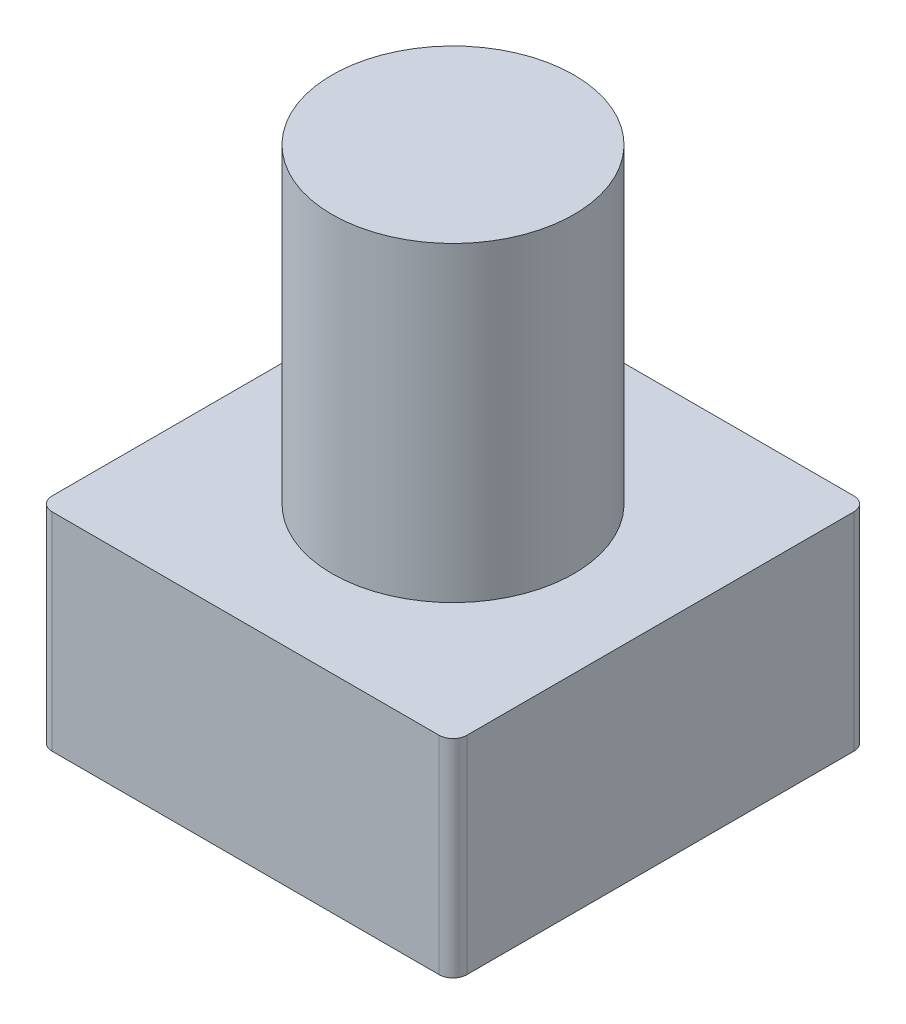
ISO-10303-21;
HEADER;
FILE_DESCRIPTION(('STEP AP214'),'2;1');
FILE_NAME('part.step','',(''),(''),'','','');
FILE_SCHEMA(('AUTOMOTIVE_DESIGN { 1 0 10303 214 1 1 1 1 }'));
ENDSEC;
DATA;
#1=APPLICATION_CONTEXT('core data for automotive mechanical design processes');
#2=APPLICATION_PROTOCOL_DEFINITION('international standard','automotive_design',2000,#1);
#3=PRODUCT_CONTEXT('',#1,'mechanical');
#4=PRODUCT('Part','Part','',(#3));
#5=PRODUCT_RELATED_PRODUCT_CATEGORY('part','',(#4));
#6=PRODUCT_DEFINITION_FORMATION('','',#4);
#7=PRODUCT_DEFINITION_CONTEXT('part definition',#1,'design');
#8=PRODUCT_DEFINITION('design','',#6,#7);
#9=PRODUCT_DEFINITION_SHAPE('','',#8);
#10=(LENGTH_UNIT() NAMED_UNIT(*) SI_UNIT(.MILLI.,.METRE.));
#11=(NAMED_UNIT(*) PLANE_ANGLE_UNIT() SI_UNIT($,.RADIAN.));
#12=(NAMED_UNIT(*) SI_UNIT($,.STERADIAN.) SOLID_ANGLE_UNIT());
#13=UNCERTAINTY_MEASURE_WITH_UNIT(LENGTH_MEASURE(1.E-05),#10,'distance_accuracy_value','');
#14=(GEOMETRIC_REPRESENTATION_CONTEXT(3) GLOBAL_UNCERTAINTY_ASSIGNED_CONTEXT((#13)) GLOBAL_UNIT_ASSIGNED_CONTEXT((#10,
#11,#12)) REPRESENTATION_CONTEXT('',''));
#15=CARTESIAN_POINT('',(0.,0.,0.));
#16=DIRECTION('',(0.,0.,1.));
#17=DIRECTION('',(1.,0.,0.));
#18=AXIS2_PLACEMENT_3D('',#15,#16,#17);
#19=CARTESIAN_POINT('',(2.8,3.,2.8));
#20=DIRECTION('',(0.,-1.,0.));
#21=DIRECTION('',(0.,0.,-1.));
#22=AXIS2_PLACEMENT_3D('',#19,#20,#21);
#23=CYLINDRICAL_SURFACE('',#22,0.2);
#24=CARTESIAN_POINT('',(2.8,0.,2.8));
#25=DIRECTION('',(0.,1.,0.));
#26=DIRECTION('',(0.,0.,1.));
#27=AXIS2_PLACEMENT_3D('',#24,#25,#26);
#28=CIRCLE('',#27,0.2);
#29=CARTESIAN_POINT('',(2.8,0.,3.));
#30=VERTEX_POINT('',#29);
#31=CARTESIAN_POINT('',(3.,0.,2.8));
#32=VERTEX_POINT('',#31);
#33=EDGE_CURVE('E148',#30,#32,#28,.T.);
#34=ORIENTED_EDGE('',*,*,#33,.T.);
#35=DIRECTION('',(0.,-1.,0.));
#36=VECTOR('',#35,1.);
#37=CARTESIAN_POINT('',(3.,3.,2.8));
#38=LINE('',#37,#36);
#39=CARTESIAN_POINT('',(3.,3.,2.8));
#40=VERTEX_POINT('',#39);
#41=EDGE_CURVE('E48',#40,#32,#38,.T.);
#42=ORIENTED_EDGE('',*,*,#41,.F.);
#43=CARTESIAN_POINT('',(2.8,3.,2.8));
#44=DIRECTION('',(0.,1.,0.));
#45=DIRECTION('',(0.,0.,1.));
#46=AXIS2_PLACEMENT_3D('',#43,#44,#45);
#47=CIRCLE('',#46,0.2);
#48=CARTESIAN_POINT('',(2.8,3.,3.));
#49=VERTEX_POINT('',#48);
#50=EDGE_CURVE('E171',#49,#40,#47,.T.);
#51=ORIENTED_EDGE('',*,*,#50,.F.);
#52=DIRECTION('',(0.,-1.,0.));
#53=VECTOR('',#52,1.);
#54=CARTESIAN_POINT('',(2.8,3.,3.));
#55=LINE('',#54,#53);
#56=EDGE_CURVE('E144',#49,#30,#55,.T.);
#57=ORIENTED_EDGE('',*,*,#56,.T.);
#58=EDGE_LOOP('',(#34,#42,#51,#57));
#59=FACE_BOUND('',#58,.T.);
#60=ADVANCED_FACE('F45',(#59),#23,.T.);
#61=CARTESIAN_POINT('',(3.,3.,2.8));
#62=DIRECTION('',(-1.,0.,0.));
#63=DIRECTION('',(0.,0.,1.));
#64=AXIS2_PLACEMENT_3D('',#61,#62,#63);
#65=PLANE('',#64);
#66=DIRECTION('',(0.,0.,-1.));
#67=VECTOR('',#66,1.);
#68=CARTESIAN_POINT('',(3.,0.,2.8));
#69=LINE('',#68,#67);
#70=CARTESIAN_POINT('',(3.,0.,-2.8));
#71=VERTEX_POINT('',#70);
#72=EDGE_CURVE('E152',#32,#71,#69,.T.);
#73=ORIENTED_EDGE('',*,*,#72,.T.);
#74=DIRECTION('',(0.,-1.,0.));
#75=VECTOR('',#74,1.);
#76=CARTESIAN_POINT('',(3.,3.,-2.8));
#77=LINE('',#76,#75);
#78=CARTESIAN_POINT('',(3.,3.,-2.8));
#79=VERTEX_POINT('',#78);
#80=EDGE_CURVE('E185',#79,#71,#77,.T.);
#81=ORIENTED_EDGE('',*,*,#80,.F.);
#82=DIRECTION('',(0.,0.,-1.));
#83=VECTOR('',#82,1.);
#84=CARTESIAN_POINT('',(3.,3.,2.8));
#85=LINE('',#84,#83);
#86=EDGE_CURVE('E107',#40,#79,#85,.T.);
#87=ORIENTED_EDGE('',*,*,#86,.F.);
#88=ORIENTED_EDGE('',*,*,#41,.T.);
#89=EDGE_LOOP('',(#73,#81,#87,#88));
#90=FACE_BOUND('',#89,.T.);
#91=ADVANCED_FACE('F193',(#90),#65,.F.);
#92=CARTESIAN_POINT('',(2.8,3.,-2.8));
#93=DIRECTION('',(0.,-1.,0.));
#94=DIRECTION('',(0.,0.,-1.));
#95=AXIS2_PLACEMENT_3D('',#92,#93,#94);
#96=CYLINDRICAL_SURFACE('',#95,0.2);
#97=CARTESIAN_POINT('',(2.8,0.,-2.8));
#98=DIRECTION('',(0.,1.,0.));
#99=DIRECTION('',(0.,0.,-1.));
#100=AXIS2_PLACEMENT_3D('',#97,#98,#99);
#101=CIRCLE('',#100,0.2);
#102=CARTESIAN_POINT('',(2.8,0.,-3.));
#103=VERTEX_POINT('',#102);
#104=EDGE_CURVE('E156',#71,#103,#101,.T.);
#105=ORIENTED_EDGE('',*,*,#104,.T.);
#106=DIRECTION('',(0.,-1.,0.));
#107=VECTOR('',#106,1.);
#108=CARTESIAN_POINT('',(2.8,3.,-3.));
#109=LINE('',#108,#107);
#110=CARTESIAN_POINT('',(2.8,3.,-3.));
#111=VERTEX_POINT('',#110);
#112=EDGE_CURVE('E182',#111,#103,#109,.T.);
#113=ORIENTED_EDGE('',*,*,#112,.F.);
#114=CARTESIAN_POINT('',(2.8,3.,-2.8));
#115=DIRECTION('',(0.,1.,0.));
#116=DIRECTION('',(0.,0.,-1.));
#117=AXIS2_PLACEMENT_3D('',#114,#115,#116);
#118=CIRCLE('',#117,0.2);
#119=EDGE_CURVE('E209',#79,#111,#118,.T.);
#120=ORIENTED_EDGE('',*,*,#119,.F.);
#121=ORIENTED_EDGE('',*,*,#80,.T.);
#122=EDGE_LOOP('',(#105,#113,#120,#121));
#123=FACE_BOUND('',#122,.T.);
#124=ADVANCED_FACE('F202',(#123),#96,.T.);
#125=CARTESIAN_POINT('',(-2.8,3.,-3.));
#126=DIRECTION('',(0.,0.,1.));
#127=DIRECTION('',(1.,0.,0.));
#128=AXIS2_PLACEMENT_3D('',#125,#126,#127);
#129=PLANE('',#128);
#130=DIRECTION('',(-1.,0.,0.));
#131=VECTOR('',#130,1.);
#132=CARTESIAN_POINT('',(-2.8,0.,-3.));
#133=LINE('',#132,#131);
#134=CARTESIAN_POINT('',(-2.8,0.,-3.));
#135=VERTEX_POINT('',#134);
#136=EDGE_CURVE('E159',#103,#135,#133,.T.);
#137=ORIENTED_EDGE('',*,*,#136,.T.);
#138=DIRECTION('',(0.,-1.,0.));
#139=VECTOR('',#138,1.);
#140=CARTESIAN_POINT('',(-2.8,3.,-3.));
#141=LINE('',#140,#139);
#142=CARTESIAN_POINT('',(-2.8,3.,-3.));
#143=VERTEX_POINT('',#142);
#144=EDGE_CURVE('E178',#143,#135,#141,.T.);
#145=ORIENTED_EDGE('',*,*,#144,.F.);
#146=DIRECTION('',(-1.,0.,0.));
#147=VECTOR('',#146,1.);
#148=CARTESIAN_POINT('',(-2.8,3.,-3.));
#149=LINE('',#148,#147);
#150=EDGE_CURVE('E207',#111,#143,#149,.T.);
#151=ORIENTED_EDGE('',*,*,#150,.F.);
#152=ORIENTED_EDGE('',*,*,#112,.T.);
#153=EDGE_LOOP('',(#137,#145,#151,#152));
#154=FACE_BOUND('',#153,.T.);
#155=ADVANCED_FACE('F205',(#154),#129,.F.);
#156=CARTESIAN_POINT('',(-2.8,3.,-2.8));
#157=DIRECTION('',(0.,-1.,0.));
#158=DIRECTION('',(0.,0.,-1.));
#159=AXIS2_PLACEMENT_3D('',#156,#157,#158);
#160=CYLINDRICAL_SURFACE('',#159,0.2);
#161=CARTESIAN_POINT('',(-2.8,0.,-2.8));
#162=DIRECTION('',(0.,1.,0.));
#163=DIRECTION('',(0.,0.,-1.));
#164=AXIS2_PLACEMENT_3D('',#161,#162,#163);
#165=CIRCLE('',#164,0.2);
#166=CARTESIAN_POINT('',(-3.,0.,-2.8));
#167=VERTEX_POINT('',#166);
#168=EDGE_CURVE('E162',#135,#167,#165,.T.);
#169=ORIENTED_EDGE('',*,*,#168,.T.);
#170=DIRECTION('',(0.,-1.,0.));
#171=VECTOR('',#170,1.);
#172=CARTESIAN_POINT('',(-3.,3.,-2.8));
#173=LINE('',#172,#171);
#174=CARTESIAN_POINT('',(-3.,3.,-2.8));
#175=VERTEX_POINT('',#174);
#176=EDGE_CURVE('E137',#175,#167,#173,.T.);
#177=ORIENTED_EDGE('',*,*,#176,.F.);
#178=CARTESIAN_POINT('',(-2.8,3.,-2.8));
#179=DIRECTION('',(0.,1.,0.));
#180=DIRECTION('',(0.,0.,-1.));
#181=AXIS2_PLACEMENT_3D('',#178,#179,#180);
#182=CIRCLE('',#181,0.2);
#183=EDGE_CURVE('E126',#143,#175,#182,.T.);
#184=ORIENTED_EDGE('',*,*,#183,.F.);
#185=ORIENTED_EDGE('',*,*,#144,.T.);
#186=EDGE_LOOP('',(#169,#177,#184,#185));
#187=FACE_BOUND('',#186,.T.);
#188=ADVANCED_FACE('F251',(#187),#160,.T.);
#189=CARTESIAN_POINT('',(-3.,3.,2.8));
#190=DIRECTION('',(1.,0.,0.));
#191=DIRECTION('',(0.,0.,-1.));
#192=AXIS2_PLACEMENT_3D('',#189,#190,#191);
#193=PLANE('',#192);
#194=DIRECTION('',(0.,0.,1.));
#195=VECTOR('',#194,1.);
#196=CARTESIAN_POINT('',(-3.,0.,2.8));
#197=LINE('',#196,#195);
#198=CARTESIAN_POINT('',(-3.,0.,2.8));
#199=VERTEX_POINT('',#198);
#200=EDGE_CURVE('E135',#167,#199,#197,.T.);
#201=ORIENTED_EDGE('',*,*,#200,.T.);
#202=DIRECTION('',(0.,-1.,0.));
#203=VECTOR('',#202,1.);
#204=CARTESIAN_POINT('',(-3.,3.,2.8));
#205=LINE('',#204,#203);
#206=CARTESIAN_POINT('',(-3.,3.,2.8));
#207=VERTEX_POINT('',#206);
#208=EDGE_CURVE('E132',#207,#199,#205,.T.);
#209=ORIENTED_EDGE('',*,*,#208,.F.);
#210=DIRECTION('',(0.,0.,1.));
#211=VECTOR('',#210,1.);
#212=CARTESIAN_POINT('',(-3.,3.,2.8));
#213=LINE('',#212,#211);
#214=EDGE_CURVE('E120',#175,#207,#213,.T.);
#215=ORIENTED_EDGE('',*,*,#214,.F.);
#216=ORIENTED_EDGE('',*,*,#176,.T.);
#217=EDGE_LOOP('',(#201,#209,#215,#216));
#218=FACE_BOUND('',#217,.T.);
#219=ADVANCED_FACE('F133',(#218),#193,.F.);
#220=CARTESIAN_POINT('',(-2.8,3.,2.8));
#221=DIRECTION('',(0.,-1.,0.));
#222=DIRECTION('',(0.,0.,-1.));
#223=AXIS2_PLACEMENT_3D('',#220,#221,#222);
#224=CYLINDRICAL_SURFACE('',#223,0.2);
#225=CARTESIAN_POINT('',(-2.8,0.,2.8));
#226=DIRECTION('',(0.,1.,0.));
#227=DIRECTION('',(0.,0.,-1.));
#228=AXIS2_PLACEMENT_3D('',#225,#226,#227);
#229=CIRCLE('',#228,0.2);
#230=CARTESIAN_POINT('',(-2.8,0.,3.));
#231=VERTEX_POINT('',#230);
#232=EDGE_CURVE('E92',#199,#231,#229,.T.);
#233=ORIENTED_EDGE('',*,*,#232,.T.);
#234=DIRECTION('',(0.,-1.,0.));
#235=VECTOR('',#234,1.);
#236=CARTESIAN_POINT('',(-2.8,3.,3.));
#237=LINE('',#236,#235);
#238=CARTESIAN_POINT('',(-2.8,3.,3.));
#239=VERTEX_POINT('',#238);
#240=EDGE_CURVE('E138',#239,#231,#237,.T.);
#241=ORIENTED_EDGE('',*,*,#240,.F.);
#242=CARTESIAN_POINT('',(-2.8,3.,2.8));
#243=DIRECTION('',(0.,1.,0.));
#244=DIRECTION('',(0.,0.,-1.));
#245=AXIS2_PLACEMENT_3D('',#242,#243,#244);
#246=CIRCLE('',#245,0.2);
#247=EDGE_CURVE('E124',#207,#239,#246,.T.);
#248=ORIENTED_EDGE('',*,*,#247,.F.);
#249=ORIENTED_EDGE('',*,*,#208,.T.);
#250=EDGE_LOOP('',(#233,#241,#248,#249));
#251=FACE_BOUND('',#250,.T.);
#252=ADVANCED_FACE('F140',(#251),#224,.T.);
#253=CARTESIAN_POINT('',(-2.8,3.,3.));
#254=DIRECTION('',(0.,0.,-1.));
#255=DIRECTION('',(-1.,0.,0.));
#256=AXIS2_PLACEMENT_3D('',#253,#254,#255);
#257=PLANE('',#256);
#258=DIRECTION('',(1.,0.,0.));
#259=VECTOR('',#258,1.);
#260=CARTESIAN_POINT('',(-2.8,0.,3.));
#261=LINE('',#260,#259);
#262=EDGE_CURVE('E98',#231,#30,#261,.T.);
#263=ORIENTED_EDGE('',*,*,#262,.T.);
#264=ORIENTED_EDGE('',*,*,#56,.F.);
#265=DIRECTION('',(1.,0.,0.));
#266=VECTOR('',#265,1.);
#267=CARTESIAN_POINT('',(-2.8,3.,3.));
#268=LINE('',#267,#266);
#269=EDGE_CURVE('E63',#239,#49,#268,.T.);
#270=ORIENTED_EDGE('',*,*,#269,.F.);
#271=ORIENTED_EDGE('',*,*,#240,.T.);
#272=EDGE_LOOP('',(#263,#264,#270,#271));
#273=FACE_BOUND('',#272,.T.);
#274=ADVANCED_FACE('F232',(#273),#257,.F.);
#275=CARTESIAN_POINT('',(2.8,3.,2.8));
#276=DIRECTION('',(0.,1.,0.));
#277=DIRECTION('',(0.,0.,1.));
#278=AXIS2_PLACEMENT_3D('',#275,#276,#277);
#279=PLANE('',#278);
#280=CARTESIAN_POINT('',(0.,3.,0.));
#281=DIRECTION('',(0.,1.,0.));
#282=DIRECTION('',(0.,0.,1.));
#283=AXIS2_PLACEMENT_3D('',#280,#281,#282);
#284=CIRCLE('',#283,1.75);
#285=CARTESIAN_POINT('',(0.,3.,1.75));
#286=VERTEX_POINT('',#285);
#287=EDGE_CURVE('E11',#286,#286,#284,.T.);
#288=ORIENTED_EDGE('',*,*,#287,.F.);
#289=EDGE_LOOP('',(#288));
#290=FACE_BOUND('',#289,.T.);
#291=ORIENTED_EDGE('',*,*,#50,.T.);
#292=ORIENTED_EDGE('',*,*,#86,.T.);
#293=ORIENTED_EDGE('',*,*,#119,.T.);
#294=ORIENTED_EDGE('',*,*,#150,.T.);
#295=ORIENTED_EDGE('',*,*,#183,.T.);
#296=ORIENTED_EDGE('',*,*,#214,.T.);
#297=ORIENTED_EDGE('',*,*,#247,.T.);
#298=ORIENTED_EDGE('',*,*,#269,.T.);
#299=EDGE_LOOP('',(#291,#292,#293,#294,#295,#296,#297,#298));
#300=FACE_BOUND('',#299,.T.);
#301=ADVANCED_FACE('F122',(#290,#300),#279,.T.);
#302=CARTESIAN_POINT('',(2.8,0.,2.8));
#303=DIRECTION('',(0.,1.,0.));
#304=DIRECTION('',(0.,0.,1.));
#305=AXIS2_PLACEMENT_3D('',#302,#303,#304);
#306=PLANE('',#305);
#307=ORIENTED_EDGE('',*,*,#33,.F.);
#308=ORIENTED_EDGE('',*,*,#262,.F.);
#309=ORIENTED_EDGE('',*,*,#232,.F.);
#310=ORIENTED_EDGE('',*,*,#200,.F.);
#311=ORIENTED_EDGE('',*,*,#168,.F.);
#312=ORIENTED_EDGE('',*,*,#136,.F.);
#313=ORIENTED_EDGE('',*,*,#104,.F.);
#314=ORIENTED_EDGE('',*,*,#72,.F.);
#315=EDGE_LOOP('',(#307,#308,#309,#310,#311,#312,#313,#314));
#316=FACE_BOUND('',#315,.T.);
#317=ADVANCED_FACE('F198',(#316),#306,.F.);
#318=CARTESIAN_POINT('',(0.,7.5,0.));
#319=DIRECTION('',(0.,-1.,0.));
#320=DIRECTION('',(0.,0.,-1.));
#321=AXIS2_PLACEMENT_3D('',#318,#319,#320);
#322=CYLINDRICAL_SURFACE('',#321,1.75);
#323=CARTESIAN_POINT('',(0.,7.5,0.));
#324=DIRECTION('',(0.,1.,0.));
#325=DIRECTION('',(0.,0.,1.));
#326=AXIS2_PLACEMENT_3D('',#323,#324,#325);
#327=CIRCLE('',#326,1.75);
#328=CARTESIAN_POINT('',(0.,7.5,1.75));
#329=VERTEX_POINT('',#328);
#330=EDGE_CURVE('E153',#329,#329,#327,.T.);
#331=ORIENTED_EDGE('',*,*,#330,.F.);
#332=EDGE_LOOP('',(#331));
#333=FACE_BOUND('',#332,.T.);
#334=ORIENTED_EDGE('',*,*,#287,.T.);
#335=EDGE_LOOP('',(#334));
#336=FACE_BOUND('',#335,.T.);
#337=ADVANCED_FACE('F225',(#333,#336),#322,.T.);
#338=CARTESIAN_POINT('',(0.,7.5,0.));
#339=DIRECTION('',(0.,1.,0.));
#340=DIRECTION('',(0.,0.,1.));
#341=AXIS2_PLACEMENT_3D('',#338,#339,#340);
#342=PLANE('',#341);
#343=ORIENTED_EDGE('',*,*,#330,.T.);
#344=EDGE_LOOP('',(#343));
#345=FACE_BOUND('',#344,.T.);
#346=ADVANCED_FACE('F223',(#345),#342,.T.);
#347=CLOSED_SHELL('',(#60,#91,#124,#155,#188,#219,#252,#274,#301,#317,#337,#346));
#348=MANIFOLD_SOLID_BREP('B2',#347);
#349=ADVANCED_BREP_SHAPE_REPRESENTATION('',(#18,#348),#14);
#350=SHAPE_DEFINITION_REPRESENTATION(#9,#349);
ENDSEC;
END-ISO-10303-21;
